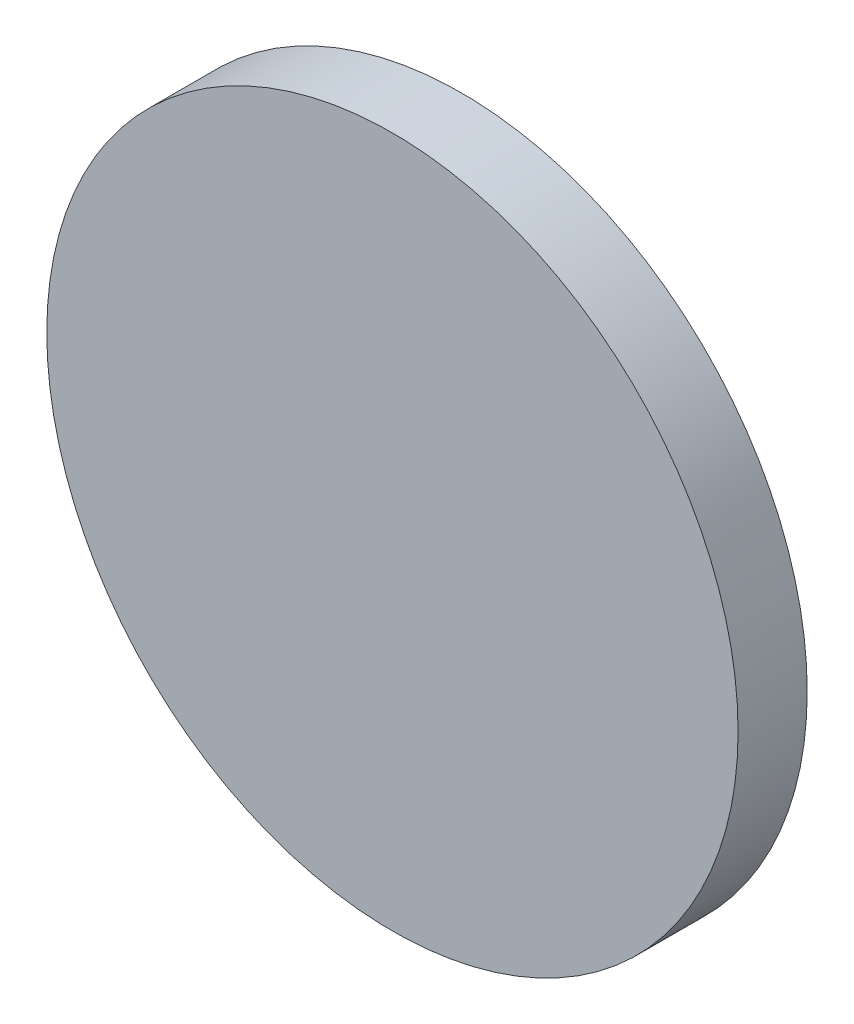
ISO-10303-21;
HEADER;
FILE_DESCRIPTION(('STEP AP214'),'2;1');
FILE_NAME('part.step','',(''),(''),'','','');
FILE_SCHEMA(('AUTOMOTIVE_DESIGN { 1 0 10303 214 1 1 1 1 }'));
ENDSEC;
DATA;
#1=APPLICATION_CONTEXT('core data for automotive mechanical design processes');
#2=APPLICATION_PROTOCOL_DEFINITION('international standard','automotive_design',2000,#1);
#3=PRODUCT_CONTEXT('',#1,'mechanical');
#4=PRODUCT('Part','Part','',(#3));
#5=PRODUCT_RELATED_PRODUCT_CATEGORY('part','',(#4));
#6=PRODUCT_DEFINITION_FORMATION('','',#4);
#7=PRODUCT_DEFINITION_CONTEXT('part definition',#1,'design');
#8=PRODUCT_DEFINITION('design','',#6,#7);
#9=PRODUCT_DEFINITION_SHAPE('','',#8);
#10=(LENGTH_UNIT() NAMED_UNIT(*) SI_UNIT(.MILLI.,.METRE.));
#11=(NAMED_UNIT(*) PLANE_ANGLE_UNIT() SI_UNIT($,.RADIAN.));
#12=(NAMED_UNIT(*) SI_UNIT($,.STERADIAN.) SOLID_ANGLE_UNIT());
#13=UNCERTAINTY_MEASURE_WITH_UNIT(LENGTH_MEASURE(1.E-05),#10,'distance_accuracy_value','');
#14=(GEOMETRIC_REPRESENTATION_CONTEXT(3) GLOBAL_UNCERTAINTY_ASSIGNED_CONTEXT((#13)) GLOBAL_UNIT_ASSIGNED_CONTEXT((#10,
#11,#12)) REPRESENTATION_CONTEXT('',''));
#15=CARTESIAN_POINT('',(0.,0.,0.));
#16=DIRECTION('',(0.,0.,1.));
#17=DIRECTION('',(1.,0.,0.));
#18=AXIS2_PLACEMENT_3D('',#15,#16,#17);
#19=CARTESIAN_POINT('',(0.,0.,3.));
#20=DIRECTION('',(0.,0.,-1.));
#21=DIRECTION('',(-1.,0.,0.));
#22=AXIS2_PLACEMENT_3D('',#19,#20,#21);
#23=CYLINDRICAL_SURFACE('',#22,15.);
#24=CARTESIAN_POINT('',(0.,0.,3.));
#25=DIRECTION('',(0.,0.,1.));
#26=DIRECTION('',(1.,0.,0.));
#27=AXIS2_PLACEMENT_3D('',#24,#25,#26);
#28=CIRCLE('',#27,15.);
#29=CARTESIAN_POINT('',(15.,0.,3.));
#30=VERTEX_POINT('',#29);
#31=EDGE_CURVE('E10',#30,#30,#28,.T.);
#32=ORIENTED_EDGE('',*,*,#31,.F.);
#33=EDGE_LOOP('',(#32));
#34=FACE_BOUND('',#33,.T.);
#35=CARTESIAN_POINT('',(0.,0.,0.));
#36=DIRECTION('',(0.,0.,1.));
#37=DIRECTION('',(1.,0.,0.));
#38=AXIS2_PLACEMENT_3D('',#35,#36,#37);
#39=CIRCLE('',#38,15.);
#40=CARTESIAN_POINT('',(15.,0.,0.));
#41=VERTEX_POINT('',#40);
#42=EDGE_CURVE('E34',#41,#41,#39,.T.);
#43=ORIENTED_EDGE('',*,*,#42,.T.);
#44=EDGE_LOOP('',(#43));
#45=FACE_BOUND('',#44,.T.);
#46=ADVANCED_FACE('F31',(#34,#45),#23,.T.);
#47=CARTESIAN_POINT('',(0.,0.,3.));
#48=DIRECTION('',(0.,0.,1.));
#49=DIRECTION('',(1.,0.,0.));
#50=AXIS2_PLACEMENT_3D('',#47,#48,#49);
#51=PLANE('',#50);
#52=ORIENTED_EDGE('',*,*,#31,.T.);
#53=EDGE_LOOP('',(#52));
#54=FACE_BOUND('',#53,.T.);
#55=ADVANCED_FACE('F46',(#54),#51,.T.);
#56=CARTESIAN_POINT('',(0.,0.,0.));
#57=DIRECTION('',(0.,0.,1.));
#58=DIRECTION('',(1.,0.,0.));
#59=AXIS2_PLACEMENT_3D('',#56,#57,#58);
#60=PLANE('',#59);
#61=ORIENTED_EDGE('',*,*,#42,.F.);
#62=EDGE_LOOP('',(#61));
#63=FACE_BOUND('',#62,.T.);
#64=ADVANCED_FACE('F44',(#63),#60,.F.);
#65=CLOSED_SHELL('',(#46,#55,#64));
#66=MANIFOLD_SOLID_BREP('B2',#65);
#67=ADVANCED_BREP_SHAPE_REPRESENTATION('',(#18,#66),#14);
#68=SHAPE_DEFINITION_REPRESENTATION(#9,#67);
ENDSEC;
END-ISO-10303-21;
